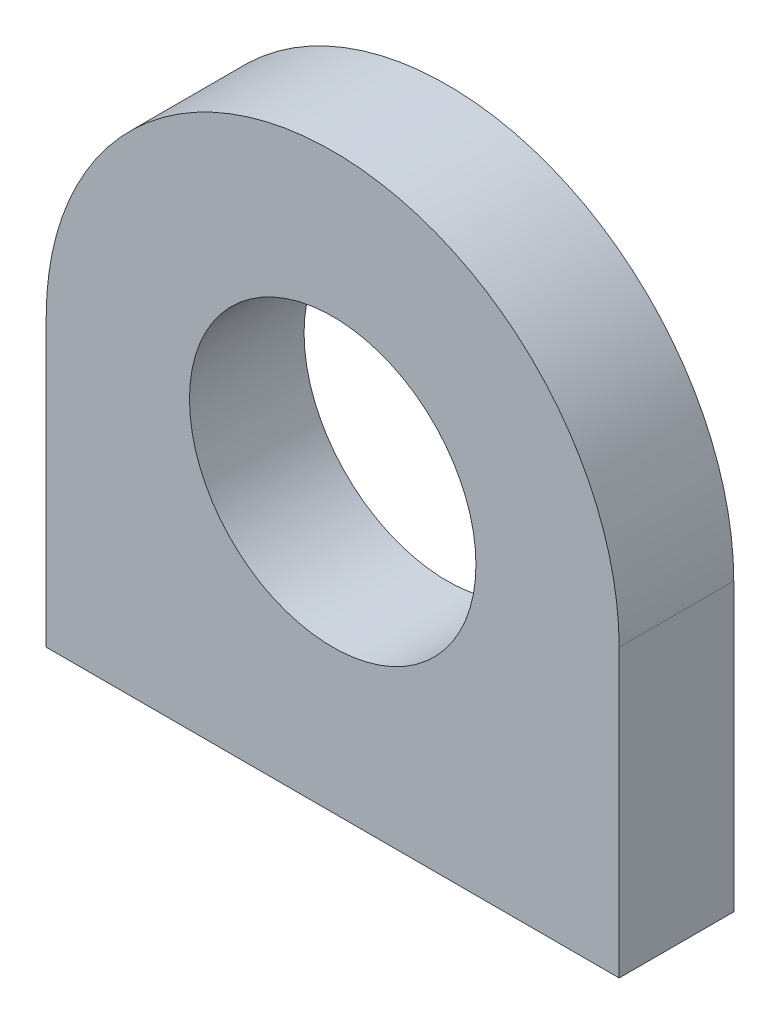
ISO-10303-21;
HEADER;
FILE_DESCRIPTION(('STEP AP214'),'2;1');
FILE_NAME('part.step','',(''),(''),'','','');
FILE_SCHEMA(('AUTOMOTIVE_DESIGN { 1 0 10303 214 1 1 1 1 }'));
ENDSEC;
DATA;
#1=APPLICATION_CONTEXT('core data for automotive mechanical design processes');
#2=APPLICATION_PROTOCOL_DEFINITION('international standard','automotive_design',2000,#1);
#3=PRODUCT_CONTEXT('',#1,'mechanical');
#4=PRODUCT('Part','Part','',(#3));
#5=PRODUCT_RELATED_PRODUCT_CATEGORY('part','',(#4));
#6=PRODUCT_DEFINITION_FORMATION('','',#4);
#7=PRODUCT_DEFINITION_CONTEXT('part definition',#1,'design');
#8=PRODUCT_DEFINITION('design','',#6,#7);
#9=PRODUCT_DEFINITION_SHAPE('','',#8);
#10=(LENGTH_UNIT() NAMED_UNIT(*) SI_UNIT(.MILLI.,.METRE.));
#11=(NAMED_UNIT(*) PLANE_ANGLE_UNIT() SI_UNIT($,.RADIAN.));
#12=(NAMED_UNIT(*) SI_UNIT($,.STERADIAN.) SOLID_ANGLE_UNIT());
#13=UNCERTAINTY_MEASURE_WITH_UNIT(LENGTH_MEASURE(1.E-05),#10,'distance_accuracy_value','');
#14=(GEOMETRIC_REPRESENTATION_CONTEXT(3) GLOBAL_UNCERTAINTY_ASSIGNED_CONTEXT((#13)) GLOBAL_UNIT_ASSIGNED_CONTEXT((#10,
#11,#12)) REPRESENTATION_CONTEXT('',''));
#15=CARTESIAN_POINT('',(0.,0.,0.));
#16=DIRECTION('',(0.,0.,1.));
#17=DIRECTION('',(1.,0.,0.));
#18=AXIS2_PLACEMENT_3D('',#15,#16,#17);
#19=CARTESIAN_POINT('',(0.,5.,4.));
#20=DIRECTION('',(0.,0.,1.));
#21=DIRECTION('',(1.,0.,0.));
#22=AXIS2_PLACEMENT_3D('',#19,#20,#21);
#23=PLANE('',#22);
#24=CARTESIAN_POINT('',(0.,5.,4.));
#25=DIRECTION('',(0.,0.,1.));
#26=DIRECTION('',(1.,0.,0.));
#27=AXIS2_PLACEMENT_3D('',#24,#25,#26);
#28=CIRCLE('',#27,10.);
#29=CARTESIAN_POINT('',(10.,5.,4.));
#30=VERTEX_POINT('',#29);
#31=CARTESIAN_POINT('',(-10.,5.,4.));
#32=VERTEX_POINT('',#31);
#33=EDGE_CURVE('E85',#30,#32,#28,.T.);
#34=ORIENTED_EDGE('',*,*,#33,.T.);
#35=DIRECTION('',(0.,-1.,0.));
#36=VECTOR('',#35,1.);
#37=CARTESIAN_POINT('',(-10.,-5.,4.));
#38=LINE('',#37,#36);
#39=CARTESIAN_POINT('',(-10.,-5.,4.));
#40=VERTEX_POINT('',#39);
#41=EDGE_CURVE('E80',#32,#40,#38,.T.);
#42=ORIENTED_EDGE('',*,*,#41,.T.);
#43=DIRECTION('',(1.,0.,0.));
#44=VECTOR('',#43,1.);
#45=CARTESIAN_POINT('',(-10.,-5.,4.));
#46=LINE('',#45,#44);
#47=CARTESIAN_POINT('',(10.,-5.,4.));
#48=VERTEX_POINT('',#47);
#49=EDGE_CURVE('E83',#40,#48,#46,.T.);
#50=ORIENTED_EDGE('',*,*,#49,.T.);
#51=DIRECTION('',(0.,1.,0.));
#52=VECTOR('',#51,1.);
#53=CARTESIAN_POINT('',(10.,-5.,4.));
#54=LINE('',#53,#52);
#55=EDGE_CURVE('E50',#48,#30,#54,.T.);
#56=ORIENTED_EDGE('',*,*,#55,.T.);
#57=EDGE_LOOP('',(#34,#42,#50,#56));
#58=FACE_BOUND('',#57,.T.);
#59=CARTESIAN_POINT('',(0.,5.,4.));
#60=DIRECTION('',(0.,0.,1.));
#61=DIRECTION('',(1.,0.,0.));
#62=AXIS2_PLACEMENT_3D('',#59,#60,#61);
#63=CIRCLE('',#62,5.);
#64=CARTESIAN_POINT('',(5.,5.,4.));
#65=VERTEX_POINT('',#64);
#66=EDGE_CURVE('E100',#65,#65,#63,.T.);
#67=ORIENTED_EDGE('',*,*,#66,.F.);
#68=EDGE_LOOP('',(#67));
#69=FACE_BOUND('',#68,.T.);
#70=ADVANCED_FACE('F33',(#58,#69),#23,.T.);
#71=CARTESIAN_POINT('',(0.,5.,0.));
#72=DIRECTION('',(0.,0.,1.));
#73=DIRECTION('',(1.,0.,0.));
#74=AXIS2_PLACEMENT_3D('',#71,#72,#73);
#75=PLANE('',#74);
#76=CARTESIAN_POINT('',(0.,5.,0.));
#77=DIRECTION('',(0.,0.,1.));
#78=DIRECTION('',(1.,0.,0.));
#79=AXIS2_PLACEMENT_3D('',#76,#77,#78);
#80=CIRCLE('',#79,10.);
#81=CARTESIAN_POINT('',(10.,5.,0.));
#82=VERTEX_POINT('',#81);
#83=CARTESIAN_POINT('',(-10.,5.,0.));
#84=VERTEX_POINT('',#83);
#85=EDGE_CURVE('E97',#82,#84,#80,.T.);
#86=ORIENTED_EDGE('',*,*,#85,.F.);
#87=DIRECTION('',(0.,1.,0.));
#88=VECTOR('',#87,1.);
#89=CARTESIAN_POINT('',(10.,-5.,0.));
#90=LINE('',#89,#88);
#91=CARTESIAN_POINT('',(10.,-5.,0.));
#92=VERTEX_POINT('',#91);
#93=EDGE_CURVE('E73',#92,#82,#90,.T.);
#94=ORIENTED_EDGE('',*,*,#93,.F.);
#95=DIRECTION('',(1.,0.,0.));
#96=VECTOR('',#95,1.);
#97=CARTESIAN_POINT('',(-10.,-5.,0.));
#98=LINE('',#97,#96);
#99=CARTESIAN_POINT('',(-10.,-5.,0.));
#100=VERTEX_POINT('',#99);
#101=EDGE_CURVE('E67',#100,#92,#98,.T.);
#102=ORIENTED_EDGE('',*,*,#101,.F.);
#103=DIRECTION('',(0.,-1.,0.));
#104=VECTOR('',#103,1.);
#105=CARTESIAN_POINT('',(-10.,-5.,0.));
#106=LINE('',#105,#104);
#107=EDGE_CURVE('E89',#84,#100,#106,.T.);
#108=ORIENTED_EDGE('',*,*,#107,.F.);
#109=EDGE_LOOP('',(#86,#94,#102,#108));
#110=FACE_BOUND('',#109,.T.);
#111=CARTESIAN_POINT('',(0.,5.,0.));
#112=DIRECTION('',(0.,0.,1.));
#113=DIRECTION('',(1.,0.,0.));
#114=AXIS2_PLACEMENT_3D('',#111,#112,#113);
#115=CIRCLE('',#114,5.);
#116=CARTESIAN_POINT('',(5.,5.,0.));
#117=VERTEX_POINT('',#116);
#118=EDGE_CURVE('E112',#117,#117,#115,.T.);
#119=ORIENTED_EDGE('',*,*,#118,.T.);
#120=EDGE_LOOP('',(#119));
#121=FACE_BOUND('',#120,.T.);
#122=ADVANCED_FACE('F108',(#110,#121),#75,.F.);
#123=CARTESIAN_POINT('',(0.,5.,4.));
#124=DIRECTION('',(0.,0.,-1.));
#125=DIRECTION('',(-1.,0.,0.));
#126=AXIS2_PLACEMENT_3D('',#123,#124,#125);
#127=CYLINDRICAL_SURFACE('',#126,10.);
#128=ORIENTED_EDGE('',*,*,#85,.T.);
#129=DIRECTION('',(0.,0.,-1.));
#130=VECTOR('',#129,1.);
#131=CARTESIAN_POINT('',(-10.,5.,4.));
#132=LINE('',#131,#130);
#133=EDGE_CURVE('E11',#32,#84,#132,.T.);
#134=ORIENTED_EDGE('',*,*,#133,.F.);
#135=ORIENTED_EDGE('',*,*,#33,.F.);
#136=DIRECTION('',(0.,0.,-1.));
#137=VECTOR('',#136,1.);
#138=CARTESIAN_POINT('',(10.,5.,4.));
#139=LINE('',#138,#137);
#140=EDGE_CURVE('E93',#30,#82,#139,.T.);
#141=ORIENTED_EDGE('',*,*,#140,.T.);
#142=EDGE_LOOP('',(#128,#134,#135,#141));
#143=FACE_BOUND('',#142,.T.);
#144=ADVANCED_FACE('F35',(#143),#127,.T.);
#145=CARTESIAN_POINT('',(-10.,-5.,4.));
#146=DIRECTION('',(1.,0.,0.));
#147=DIRECTION('',(0.,0.,-1.));
#148=AXIS2_PLACEMENT_3D('',#145,#146,#147);
#149=PLANE('',#148);
#150=ORIENTED_EDGE('',*,*,#107,.T.);
#151=DIRECTION('',(0.,0.,-1.));
#152=VECTOR('',#151,1.);
#153=CARTESIAN_POINT('',(-10.,-5.,4.));
#154=LINE('',#153,#152);
#155=EDGE_CURVE('E42',#40,#100,#154,.T.);
#156=ORIENTED_EDGE('',*,*,#155,.F.);
#157=ORIENTED_EDGE('',*,*,#41,.F.);
#158=ORIENTED_EDGE('',*,*,#133,.T.);
#159=EDGE_LOOP('',(#150,#156,#157,#158));
#160=FACE_BOUND('',#159,.T.);
#161=ADVANCED_FACE('F88',(#160),#149,.F.);
#162=CARTESIAN_POINT('',(-10.,-5.,4.));
#163=DIRECTION('',(0.,1.,0.));
#164=DIRECTION('',(0.,0.,1.));
#165=AXIS2_PLACEMENT_3D('',#162,#163,#164);
#166=PLANE('',#165);
#167=CARTESIAN_POINT('',(-7.,-5.,2.));
#168=DIRECTION('',(0.,-1.,0.));
#169=DIRECTION('',(0.,0.,-1.));
#170=AXIS2_PLACEMENT_3D('',#167,#168,#169);
#171=CIRCLE('',#170,1.);
#172=CARTESIAN_POINT('',(-7.,-5.,0.999999999999999));
#173=VERTEX_POINT('',#172);
#174=EDGE_CURVE('E124',#173,#173,#171,.T.);
#175=ORIENTED_EDGE('',*,*,#174,.F.);
#176=EDGE_LOOP('',(#175));
#177=FACE_BOUND('',#176,.T.);
#178=CARTESIAN_POINT('',(7.,-5.,2.));
#179=DIRECTION('',(0.,-1.,0.));
#180=DIRECTION('',(0.,0.,-1.));
#181=AXIS2_PLACEMENT_3D('',#178,#179,#180);
#182=CIRCLE('',#181,0.999999999999829);
#183=CARTESIAN_POINT('',(7.,-5.,1.00000000000017));
#184=VERTEX_POINT('',#183);
#185=EDGE_CURVE('E118',#184,#184,#182,.T.);
#186=ORIENTED_EDGE('',*,*,#185,.F.);
#187=EDGE_LOOP('',(#186));
#188=FACE_BOUND('',#187,.T.);
#189=ORIENTED_EDGE('',*,*,#101,.T.);
#190=DIRECTION('',(0.,0.,-1.));
#191=VECTOR('',#190,1.);
#192=CARTESIAN_POINT('',(10.,-5.,4.));
#193=LINE('',#192,#191);
#194=EDGE_CURVE('E90',#48,#92,#193,.T.);
#195=ORIENTED_EDGE('',*,*,#194,.F.);
#196=ORIENTED_EDGE('',*,*,#49,.F.);
#197=ORIENTED_EDGE('',*,*,#155,.T.);
#198=EDGE_LOOP('',(#189,#195,#196,#197));
#199=FACE_BOUND('',#198,.T.);
#200=ADVANCED_FACE('F91',(#177,#188,#199),#166,.F.);
#201=CARTESIAN_POINT('',(10.,-5.,4.));
#202=DIRECTION('',(-1.,0.,0.));
#203=DIRECTION('',(0.,0.,1.));
#204=AXIS2_PLACEMENT_3D('',#201,#202,#203);
#205=PLANE('',#204);
#206=ORIENTED_EDGE('',*,*,#93,.T.);
#207=ORIENTED_EDGE('',*,*,#140,.F.);
#208=ORIENTED_EDGE('',*,*,#55,.F.);
#209=ORIENTED_EDGE('',*,*,#194,.T.);
#210=EDGE_LOOP('',(#206,#207,#208,#209));
#211=FACE_BOUND('',#210,.T.);
#212=ADVANCED_FACE('F105',(#211),#205,.F.);
#213=CARTESIAN_POINT('',(0.,5.,4.));
#214=DIRECTION('',(0.,0.,-1.));
#215=DIRECTION('',(-1.,0.,0.));
#216=AXIS2_PLACEMENT_3D('',#213,#214,#215);
#217=CYLINDRICAL_SURFACE('',#216,5.);
#218=ORIENTED_EDGE('',*,*,#66,.T.);
#219=EDGE_LOOP('',(#218));
#220=FACE_BOUND('',#219,.T.);
#221=ORIENTED_EDGE('',*,*,#118,.F.);
#222=EDGE_LOOP('',(#221));
#223=FACE_BOUND('',#222,.T.);
#224=ADVANCED_FACE('F146',(#220,#223),#217,.F.);
#225=CARTESIAN_POINT('',(7.,-0.999999999999999,2.));
#226=DIRECTION('',(0.,-1.,0.));
#227=DIRECTION('',(0.,0.,-1.));
#228=AXIS2_PLACEMENT_3D('',#225,#226,#227);
#229=CYLINDRICAL_SURFACE('',#228,0.999999999999829);
#230=CARTESIAN_POINT('',(7.,-0.999999999999999,2.));
#231=DIRECTION('',(0.,-1.,0.));
#232=DIRECTION('',(0.,0.,-1.));
#233=AXIS2_PLACEMENT_3D('',#230,#231,#232);
#234=CIRCLE('',#233,0.999999999999829);
#235=CARTESIAN_POINT('',(7.,-0.999999999999999,1.00000000000017));
#236=VERTEX_POINT('',#235);
#237=EDGE_CURVE('E121',#236,#236,#234,.T.);
#238=ORIENTED_EDGE('',*,*,#237,.F.);
#239=EDGE_LOOP('',(#238));
#240=FACE_BOUND('',#239,.T.);
#241=ORIENTED_EDGE('',*,*,#185,.T.);
#242=EDGE_LOOP('',(#241));
#243=FACE_BOUND('',#242,.T.);
#244=ADVANCED_FACE('F144',(#240,#243),#229,.F.);
#245=CARTESIAN_POINT('',(7.,-0.999999999999999,2.));
#246=DIRECTION('',(0.,-1.,0.));
#247=DIRECTION('',(0.,0.,-1.));
#248=AXIS2_PLACEMENT_3D('',#245,#246,#247);
#249=PLANE('',#248);
#250=ORIENTED_EDGE('',*,*,#237,.T.);
#251=EDGE_LOOP('',(#250));
#252=FACE_BOUND('',#251,.T.);
#253=ADVANCED_FACE('F135',(#252),#249,.T.);
#254=CARTESIAN_POINT('',(-7.,-0.999999999999999,2.));
#255=DIRECTION('',(0.,-1.,0.));
#256=DIRECTION('',(0.,0.,-1.));
#257=AXIS2_PLACEMENT_3D('',#254,#255,#256);
#258=CYLINDRICAL_SURFACE('',#257,1.);
#259=CARTESIAN_POINT('',(-7.,-0.999999999999999,2.));
#260=DIRECTION('',(0.,-1.,0.));
#261=DIRECTION('',(0.,0.,-1.));
#262=AXIS2_PLACEMENT_3D('',#259,#260,#261);
#263=CIRCLE('',#262,1.);
#264=CARTESIAN_POINT('',(-7.,-0.999999999999999,0.999999999999999));
#265=VERTEX_POINT('',#264);
#266=EDGE_CURVE('E115',#265,#265,#263,.T.);
#267=ORIENTED_EDGE('',*,*,#266,.F.);
#268=EDGE_LOOP('',(#267));
#269=FACE_BOUND('',#268,.T.);
#270=ORIENTED_EDGE('',*,*,#174,.T.);
#271=EDGE_LOOP('',(#270));
#272=FACE_BOUND('',#271,.T.);
#273=ADVANCED_FACE('F132',(#269,#272),#258,.F.);
#274=CARTESIAN_POINT('',(-7.,-0.999999999999999,2.));
#275=DIRECTION('',(0.,-1.,0.));
#276=DIRECTION('',(0.,0.,-1.));
#277=AXIS2_PLACEMENT_3D('',#274,#275,#276);
#278=PLANE('',#277);
#279=ORIENTED_EDGE('',*,*,#266,.T.);
#280=EDGE_LOOP('',(#279));
#281=FACE_BOUND('',#280,.T.);
#282=ADVANCED_FACE('F130',(#281),#278,.T.);
#283=CLOSED_SHELL('',(#70,#122,#144,#161,#200,#212,#224,#244,#253,#273,#282));
#284=MANIFOLD_SOLID_BREP('B2',#283);
#285=ADVANCED_BREP_SHAPE_REPRESENTATION('',(#18,#284),#14);
#286=SHAPE_DEFINITION_REPRESENTATION(#9,#285);
ENDSEC;
END-ISO-10303-21;
